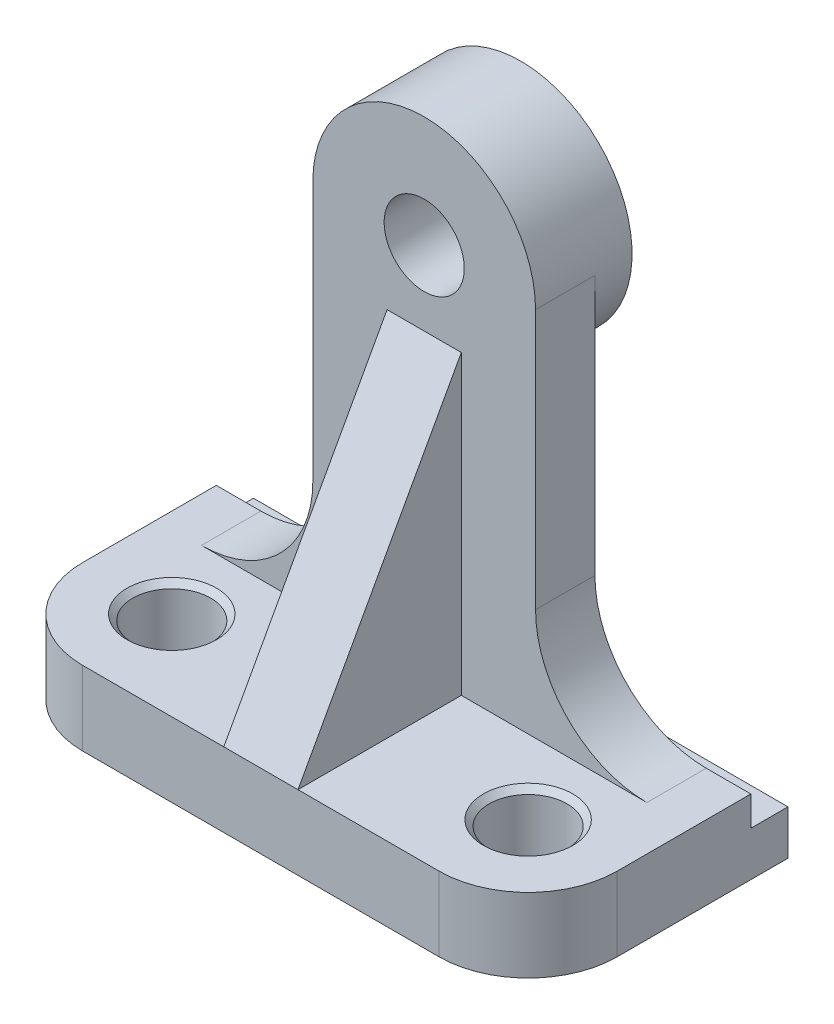
ISO-10303-21;
HEADER;
FILE_DESCRIPTION(('STEP AP214'),'2;1');
FILE_NAME('part.step','',(''),(''),'','','');
FILE_SCHEMA(('AUTOMOTIVE_DESIGN { 1 0 10303 214 1 1 1 1 }'));
ENDSEC;
DATA;
#1=APPLICATION_CONTEXT('core data for automotive mechanical design processes');
#2=APPLICATION_PROTOCOL_DEFINITION('international standard','automotive_design',2000,#1);
#3=PRODUCT_CONTEXT('',#1,'mechanical');
#4=PRODUCT('Part','Part','',(#3));
#5=PRODUCT_RELATED_PRODUCT_CATEGORY('part','',(#4));
#6=PRODUCT_DEFINITION_FORMATION('','',#4);
#7=PRODUCT_DEFINITION_CONTEXT('part definition',#1,'design');
#8=PRODUCT_DEFINITION('design','',#6,#7);
#9=PRODUCT_DEFINITION_SHAPE('','',#8);
#10=(LENGTH_UNIT() NAMED_UNIT(*) SI_UNIT(.MILLI.,.METRE.));
#11=(NAMED_UNIT(*) PLANE_ANGLE_UNIT() SI_UNIT($,.RADIAN.));
#12=(NAMED_UNIT(*) SI_UNIT($,.STERADIAN.) SOLID_ANGLE_UNIT());
#13=UNCERTAINTY_MEASURE_WITH_UNIT(LENGTH_MEASURE(1.E-05),#10,'distance_accuracy_value','');
#14=(GEOMETRIC_REPRESENTATION_CONTEXT(3) GLOBAL_UNCERTAINTY_ASSIGNED_CONTEXT((#13)) GLOBAL_UNIT_ASSIGNED_CONTEXT((#10,
#11,#12)) REPRESENTATION_CONTEXT('',''));
#15=CARTESIAN_POINT('',(0.,0.,0.));
#16=DIRECTION('',(0.,0.,1.));
#17=DIRECTION('',(1.,0.,0.));
#18=AXIS2_PLACEMENT_3D('',#15,#16,#17);
#19=CARTESIAN_POINT('',(0.,10.,0.));
#20=DIRECTION('',(0.,-1.,0.));
#21=DIRECTION('',(0.,0.,-1.));
#22=AXIS2_PLACEMENT_3D('',#19,#20,#21);
#23=PLANE('',#22);
#24=CARTESIAN_POINT('',(12.,10.,-12.));
#25=DIRECTION('',(0.,1.,0.));
#26=DIRECTION('',(0.,0.,1.));
#27=AXIS2_PLACEMENT_3D('',#24,#25,#26);
#28=CIRCLE('',#27,6.025);
#29=CARTESIAN_POINT('',(12.,10.,-5.975));
#30=VERTEX_POINT('',#29);
#31=EDGE_CURVE('E384',#30,#30,#28,.T.);
#32=ORIENTED_EDGE('',*,*,#31,.F.);
#33=EDGE_LOOP('',(#32));
#34=FACE_BOUND('',#33,.T.);
#35=DIRECTION('',(0.,0.,1.));
#36=VECTOR('',#35,1.);
#37=CARTESIAN_POINT('',(0.,10.,0.));
#38=LINE('',#37,#36);
#39=CARTESIAN_POINT('',(0.,10.,-30.));
#40=VERTEX_POINT('',#39);
#41=CARTESIAN_POINT('',(0.,10.,-12.));
#42=VERTEX_POINT('',#41);
#43=EDGE_CURVE('E208',#40,#42,#38,.T.);
#44=ORIENTED_EDGE('',*,*,#43,.T.);
#45=CARTESIAN_POINT('',(12.,10.,-12.));
#46=DIRECTION('',(0.,-1.,0.));
#47=DIRECTION('',(0.,0.,-1.));
#48=AXIS2_PLACEMENT_3D('',#45,#46,#47);
#49=CIRCLE('',#48,12.);
#50=CARTESIAN_POINT('',(12.,10.,0.));
#51=VERTEX_POINT('',#50);
#52=EDGE_CURVE('E256',#42,#51,#49,.F.);
#53=ORIENTED_EDGE('',*,*,#52,.T.);
#54=DIRECTION('',(1.,0.,0.));
#55=VECTOR('',#54,1.);
#56=CARTESIAN_POINT('',(72.,10.,0.));
#57=LINE('',#56,#55);
#58=CARTESIAN_POINT('',(31.,10.,0.));
#59=VERTEX_POINT('',#58);
#60=EDGE_CURVE('E197',#51,#59,#57,.T.);
#61=ORIENTED_EDGE('',*,*,#60,.T.);
#62=DIRECTION('',(0.,0.,1.));
#63=VECTOR('',#62,1.);
#64=CARTESIAN_POINT('',(31.,10.,0.));
#65=LINE('',#64,#63);
#66=CARTESIAN_POINT('',(31.,10.,-22.));
#67=VERTEX_POINT('',#66);
#68=EDGE_CURVE('E191',#67,#59,#65,.T.);
#69=ORIENTED_EDGE('',*,*,#68,.F.);
#70=DIRECTION('',(1.,0.,0.));
#71=VECTOR('',#70,1.);
#72=CARTESIAN_POINT('',(0.,10.,-22.));
#73=LINE('',#72,#71);
#74=CARTESIAN_POINT('',(6.,10.,-22.));
#75=VERTEX_POINT('',#74);
#76=EDGE_CURVE('E425',#75,#67,#73,.T.);
#77=ORIENTED_EDGE('',*,*,#76,.F.);
#78=DIRECTION('',(0.,0.,-1.));
#79=VECTOR('',#78,1.);
#80=CARTESIAN_POINT('',(6.,10.,-30.));
#81=LINE('',#80,#79);
#82=CARTESIAN_POINT('',(6.,10.,-30.));
#83=VERTEX_POINT('',#82);
#84=EDGE_CURVE('E229',#75,#83,#81,.T.);
#85=ORIENTED_EDGE('',*,*,#84,.T.);
#86=DIRECTION('',(1.,0.,0.));
#87=VECTOR('',#86,1.);
#88=CARTESIAN_POINT('',(0.,10.,-30.));
#89=LINE('',#88,#87);
#90=EDGE_CURVE('E286',#40,#83,#89,.T.);
#91=ORIENTED_EDGE('',*,*,#90,.F.);
#92=EDGE_LOOP('',(#44,#53,#61,#69,#77,#85,#91));
#93=FACE_BOUND('',#92,.T.);
#94=ADVANCED_FACE('F44',(#34,#93),#23,.F.);
#95=CARTESIAN_POINT('',(60.,10.,-12.));
#96=DIRECTION('',(0.,1.,0.));
#97=DIRECTION('',(0.,0.,1.));
#98=AXIS2_PLACEMENT_3D('',#95,#96,#97);
#99=CIRCLE('',#98,6.025);
#100=CARTESIAN_POINT('',(60.,10.,-5.975));
#101=VERTEX_POINT('',#100);
#102=EDGE_CURVE('E391',#101,#101,#99,.T.);
#103=ORIENTED_EDGE('',*,*,#102,.F.);
#104=EDGE_LOOP('',(#103));
#105=FACE_BOUND('',#104,.T.);
#106=CARTESIAN_POINT('',(41.,10.,0.));
#107=VERTEX_POINT('',#106);
#108=CARTESIAN_POINT('',(60.,10.,0.));
#109=VERTEX_POINT('',#108);
#110=EDGE_CURVE('E187',#107,#109,#57,.T.);
#111=ORIENTED_EDGE('',*,*,#110,.T.);
#112=CARTESIAN_POINT('',(60.,10.,-12.));
#113=DIRECTION('',(0.,-1.,0.));
#114=DIRECTION('',(0.,0.,-1.));
#115=AXIS2_PLACEMENT_3D('',#112,#113,#114);
#116=CIRCLE('',#115,12.);
#117=CARTESIAN_POINT('',(72.,10.,-12.));
#118=VERTEX_POINT('',#117);
#119=EDGE_CURVE('E11',#109,#118,#116,.F.);
#120=ORIENTED_EDGE('',*,*,#119,.T.);
#121=DIRECTION('',(0.,0.,-1.));
#122=VECTOR('',#121,1.);
#123=CARTESIAN_POINT('',(72.,10.,-35.));
#124=LINE('',#123,#122);
#125=CARTESIAN_POINT('',(72.,10.,-30.));
#126=VERTEX_POINT('',#125);
#127=EDGE_CURVE('E200',#118,#126,#124,.T.);
#128=ORIENTED_EDGE('',*,*,#127,.T.);
#129=CARTESIAN_POINT('',(66.,10.,-30.));
#130=VERTEX_POINT('',#129);
#131=EDGE_CURVE('E288',#130,#126,#89,.T.);
#132=ORIENTED_EDGE('',*,*,#131,.F.);
#133=DIRECTION('',(0.,0.,-1.));
#134=VECTOR('',#133,1.);
#135=CARTESIAN_POINT('',(66.,10.,0.));
#136=LINE('',#135,#134);
#137=CARTESIAN_POINT('',(66.,10.,-22.));
#138=VERTEX_POINT('',#137);
#139=EDGE_CURVE('E222',#130,#138,#136,.F.);
#140=ORIENTED_EDGE('',*,*,#139,.T.);
#141=CARTESIAN_POINT('',(41.,10.,-22.));
#142=VERTEX_POINT('',#141);
#143=EDGE_CURVE('E189',#142,#138,#73,.T.);
#144=ORIENTED_EDGE('',*,*,#143,.F.);
#145=DIRECTION('',(0.,0.,-1.));
#146=VECTOR('',#145,1.);
#147=CARTESIAN_POINT('',(41.,10.,0.));
#148=LINE('',#147,#146);
#149=EDGE_CURVE('E179',#107,#142,#148,.T.);
#150=ORIENTED_EDGE('',*,*,#149,.F.);
#151=EDGE_LOOP('',(#111,#120,#128,#132,#140,#144,#150));
#152=FACE_BOUND('',#151,.T.);
#153=ADVANCED_FACE('F186',(#105,#152),#23,.F.);
#154=CARTESIAN_POINT('',(0.,0.,-22.));
#155=DIRECTION('',(0.,0.,-1.));
#156=DIRECTION('',(-1.,0.,0.));
#157=AXIS2_PLACEMENT_3D('',#154,#155,#156);
#158=PLANE('',#157);
#159=DIRECTION('',(0.,-1.,0.));
#160=VECTOR('',#159,1.);
#161=CARTESIAN_POINT('',(31.,50.,-22.));
#162=LINE('',#161,#160);
#163=CARTESIAN_POINT('',(31.,50.,-22.));
#164=VERTEX_POINT('',#163);
#165=EDGE_CURVE('E401',#164,#67,#162,.T.);
#166=ORIENTED_EDGE('',*,*,#165,.F.);
#167=DIRECTION('',(-1.,0.,0.));
#168=VECTOR('',#167,1.);
#169=CARTESIAN_POINT('',(41.,50.,-22.));
#170=LINE('',#169,#168);
#171=CARTESIAN_POINT('',(41.,50.,-22.));
#172=VERTEX_POINT('',#171);
#173=EDGE_CURVE('E190',#172,#164,#170,.T.);
#174=ORIENTED_EDGE('',*,*,#173,.F.);
#175=DIRECTION('',(0.,-1.,0.));
#176=VECTOR('',#175,1.);
#177=CARTESIAN_POINT('',(41.,50.,-22.));
#178=LINE('',#177,#176);
#179=EDGE_CURVE('E181',#172,#142,#178,.T.);
#180=ORIENTED_EDGE('',*,*,#179,.T.);
#181=ORIENTED_EDGE('',*,*,#143,.T.);
#182=CARTESIAN_POINT('',(66.,25.,-22.));
#183=DIRECTION('',(0.,0.,-1.));
#184=DIRECTION('',(-1.,0.,0.));
#185=AXIS2_PLACEMENT_3D('',#182,#183,#184);
#186=CIRCLE('',#185,15.);
#187=CARTESIAN_POINT('',(51.,25.,-22.));
#188=VERTEX_POINT('',#187);
#189=EDGE_CURVE('E245',#138,#188,#186,.T.);
#190=ORIENTED_EDGE('',*,*,#189,.T.);
#191=DIRECTION('',(0.,-1.,0.));
#192=VECTOR('',#191,1.);
#193=CARTESIAN_POINT('',(51.,0.,-22.));
#194=LINE('',#193,#192);
#195=CARTESIAN_POINT('',(51.,60.,-22.));
#196=VERTEX_POINT('',#195);
#197=EDGE_CURVE('E422',#196,#188,#194,.T.);
#198=ORIENTED_EDGE('',*,*,#197,.F.);
#199=CARTESIAN_POINT('',(36.,60.,-22.));
#200=DIRECTION('',(0.,0.,-1.));
#201=DIRECTION('',(-1.,0.,0.));
#202=AXIS2_PLACEMENT_3D('',#199,#200,#201);
#203=CIRCLE('',#202,15.);
#204=CARTESIAN_POINT('',(21.,60.,-22.));
#205=VERTEX_POINT('',#204);
#206=EDGE_CURVE('E418',#205,#196,#203,.T.);
#207=ORIENTED_EDGE('',*,*,#206,.F.);
#208=DIRECTION('',(0.,-1.,0.));
#209=VECTOR('',#208,1.);
#210=CARTESIAN_POINT('',(21.,0.,-22.));
#211=LINE('',#210,#209);
#212=CARTESIAN_POINT('',(21.,25.,-22.));
#213=VERTEX_POINT('',#212);
#214=EDGE_CURVE('E416',#205,#213,#211,.T.);
#215=ORIENTED_EDGE('',*,*,#214,.T.);
#216=CARTESIAN_POINT('',(6.,25.,-22.));
#217=DIRECTION('',(0.,0.,-1.));
#218=DIRECTION('',(-1.,0.,0.));
#219=AXIS2_PLACEMENT_3D('',#216,#217,#218);
#220=CIRCLE('',#219,15.);
#221=EDGE_CURVE('E240',#213,#75,#220,.T.);
#222=ORIENTED_EDGE('',*,*,#221,.T.);
#223=ORIENTED_EDGE('',*,*,#76,.T.);
#224=EDGE_LOOP('',(#166,#174,#180,#181,#190,#198,#207,#215,#222,#223));
#225=FACE_BOUND('',#224,.T.);
#226=CARTESIAN_POINT('',(36.,60.,-22.));
#227=DIRECTION('',(0.,0.,-1.));
#228=DIRECTION('',(-1.,0.,0.));
#229=AXIS2_PLACEMENT_3D('',#226,#227,#228);
#230=CIRCLE('',#229,5.4);
#231=CARTESIAN_POINT('',(30.6,60.,-22.));
#232=VERTEX_POINT('',#231);
#233=EDGE_CURVE('E223',#232,#232,#230,.T.);
#234=ORIENTED_EDGE('',*,*,#233,.T.);
#235=EDGE_LOOP('',(#234));
#236=FACE_BOUND('',#235,.T.);
#237=ADVANCED_FACE('F316',(#225,#236),#158,.F.);
#238=CARTESIAN_POINT('',(0.,6.,-30.));
#239=DIRECTION('',(0.,0.,1.));
#240=DIRECTION('',(1.,0.,0.));
#241=AXIS2_PLACEMENT_3D('',#238,#239,#240);
#242=PLANE('',#241);
#243=CARTESIAN_POINT('',(36.,60.,-30.));
#244=DIRECTION('',(0.,0.,-1.));
#245=DIRECTION('',(-1.,0.,0.));
#246=AXIS2_PLACEMENT_3D('',#243,#244,#245);
#247=CIRCLE('',#246,15.);
#248=CARTESIAN_POINT('',(51.,60.,-30.));
#249=VERTEX_POINT('',#248);
#250=CARTESIAN_POINT('',(21.,60.,-30.));
#251=VERTEX_POINT('',#250);
#252=EDGE_CURVE('E226',#249,#251,#247,.T.);
#253=ORIENTED_EDGE('',*,*,#252,.F.);
#254=DIRECTION('',(0.,-1.,0.));
#255=VECTOR('',#254,1.);
#256=CARTESIAN_POINT('',(51.,0.,-30.));
#257=LINE('',#256,#255);
#258=CARTESIAN_POINT('',(51.,25.,-30.));
#259=VERTEX_POINT('',#258);
#260=EDGE_CURVE('E419',#249,#259,#257,.T.);
#261=ORIENTED_EDGE('',*,*,#260,.T.);
#262=CARTESIAN_POINT('',(66.,25.,-30.));
#263=DIRECTION('',(0.,0.,1.));
#264=DIRECTION('',(1.,0.,0.));
#265=AXIS2_PLACEMENT_3D('',#262,#263,#264);
#266=CIRCLE('',#265,15.);
#267=EDGE_CURVE('E243',#259,#130,#266,.T.);
#268=ORIENTED_EDGE('',*,*,#267,.T.);
#269=ORIENTED_EDGE('',*,*,#131,.T.);
#270=DIRECTION('',(0.,1.,0.));
#271=VECTOR('',#270,1.);
#272=CARTESIAN_POINT('',(72.,6.,-30.));
#273=LINE('',#272,#271);
#274=CARTESIAN_POINT('',(72.,6.,-30.));
#275=VERTEX_POINT('',#274);
#276=EDGE_CURVE('E214',#275,#126,#273,.T.);
#277=ORIENTED_EDGE('',*,*,#276,.F.);
#278=DIRECTION('',(1.,0.,0.));
#279=VECTOR('',#278,1.);
#280=CARTESIAN_POINT('',(0.,6.,-30.));
#281=LINE('',#280,#279);
#282=CARTESIAN_POINT('',(0.,6.,-30.));
#283=VERTEX_POINT('',#282);
#284=EDGE_CURVE('E279',#283,#275,#281,.T.);
#285=ORIENTED_EDGE('',*,*,#284,.F.);
#286=DIRECTION('',(0.,1.,0.));
#287=VECTOR('',#286,1.);
#288=CARTESIAN_POINT('',(0.,6.,-30.));
#289=LINE('',#288,#287);
#290=EDGE_CURVE('E205',#283,#40,#289,.T.);
#291=ORIENTED_EDGE('',*,*,#290,.T.);
#292=ORIENTED_EDGE('',*,*,#90,.T.);
#293=CARTESIAN_POINT('',(6.,25.,-30.));
#294=DIRECTION('',(0.,0.,1.));
#295=DIRECTION('',(1.,0.,0.));
#296=AXIS2_PLACEMENT_3D('',#293,#294,#295);
#297=CIRCLE('',#296,15.);
#298=CARTESIAN_POINT('',(21.,25.,-30.));
#299=VERTEX_POINT('',#298);
#300=EDGE_CURVE('E238',#83,#299,#297,.T.);
#301=ORIENTED_EDGE('',*,*,#300,.T.);
#302=DIRECTION('',(0.,-1.,0.));
#303=VECTOR('',#302,1.);
#304=CARTESIAN_POINT('',(21.,0.,-30.));
#305=LINE('',#304,#303);
#306=EDGE_CURVE('E413',#251,#299,#305,.T.);
#307=ORIENTED_EDGE('',*,*,#306,.F.);
#308=EDGE_LOOP('',(#253,#261,#268,#269,#277,#285,#291,#292,#301,#307));
#309=FACE_BOUND('',#308,.T.);
#310=ADVANCED_FACE('F293',(#309),#242,.F.);
#311=CARTESIAN_POINT('',(72.,10.,0.));
#312=DIRECTION('',(0.,0.,-1.));
#313=DIRECTION('',(-1.,0.,0.));
#314=AXIS2_PLACEMENT_3D('',#311,#312,#313);
#315=PLANE('',#314);
#316=ORIENTED_EDGE('',*,*,#60,.F.);
#317=DIRECTION('',(0.,-1.,0.));
#318=VECTOR('',#317,1.);
#319=CARTESIAN_POINT('',(12.,10.,0.));
#320=LINE('',#319,#318);
#321=CARTESIAN_POINT('',(12.,0.,0.));
#322=VERTEX_POINT('',#321);
#323=EDGE_CURVE('E248',#51,#322,#320,.T.);
#324=ORIENTED_EDGE('',*,*,#323,.T.);
#325=DIRECTION('',(1.,0.,0.));
#326=VECTOR('',#325,1.);
#327=CARTESIAN_POINT('',(72.,0.,0.));
#328=LINE('',#327,#326);
#329=CARTESIAN_POINT('',(60.,0.,0.));
#330=VERTEX_POINT('',#329);
#331=EDGE_CURVE('E211',#322,#330,#328,.T.);
#332=ORIENTED_EDGE('',*,*,#331,.T.);
#333=DIRECTION('',(0.,-1.,0.));
#334=VECTOR('',#333,1.);
#335=CARTESIAN_POINT('',(60.,10.,0.));
#336=LINE('',#335,#334);
#337=EDGE_CURVE('E196',#330,#109,#336,.F.);
#338=ORIENTED_EDGE('',*,*,#337,.T.);
#339=ORIENTED_EDGE('',*,*,#110,.F.);
#340=DIRECTION('',(1.,0.,0.));
#341=VECTOR('',#340,1.);
#342=CARTESIAN_POINT('',(0.999999999999994,10.,0.));
#343=LINE('',#342,#341);
#344=EDGE_CURVE('E164',#59,#107,#343,.T.);
#345=ORIENTED_EDGE('',*,*,#344,.F.);
#346=EDGE_LOOP('',(#316,#324,#332,#338,#339,#345));
#347=FACE_BOUND('',#346,.T.);
#348=ADVANCED_FACE('F193',(#347),#315,.F.);
#349=CARTESIAN_POINT('',(72.,10.,-35.));
#350=DIRECTION('',(-1.,0.,0.));
#351=DIRECTION('',(0.,0.,1.));
#352=AXIS2_PLACEMENT_3D('',#349,#350,#351);
#353=PLANE('',#352);
#354=ORIENTED_EDGE('',*,*,#127,.F.);
#355=DIRECTION('',(0.,-1.,0.));
#356=VECTOR('',#355,1.);
#357=CARTESIAN_POINT('',(72.,10.,-12.));
#358=LINE('',#357,#356);
#359=CARTESIAN_POINT('',(72.,0.,-12.));
#360=VERTEX_POINT('',#359);
#361=EDGE_CURVE('E52',#118,#360,#358,.T.);
#362=ORIENTED_EDGE('',*,*,#361,.T.);
#363=DIRECTION('',(0.,0.,-1.));
#364=VECTOR('',#363,1.);
#365=CARTESIAN_POINT('',(72.,0.,-35.));
#366=LINE('',#365,#364);
#367=CARTESIAN_POINT('',(72.,0.,-35.));
#368=VERTEX_POINT('',#367);
#369=EDGE_CURVE('E213',#360,#368,#366,.T.);
#370=ORIENTED_EDGE('',*,*,#369,.T.);
#371=DIRECTION('',(0.,-1.,0.));
#372=VECTOR('',#371,1.);
#373=CARTESIAN_POINT('',(72.,10.,-35.));
#374=LINE('',#373,#372);
#375=CARTESIAN_POINT('',(72.,6.,-35.));
#376=VERTEX_POINT('',#375);
#377=EDGE_CURVE('E219',#376,#368,#374,.T.);
#378=ORIENTED_EDGE('',*,*,#377,.F.);
#379=DIRECTION('',(0.,0.,-1.));
#380=VECTOR('',#379,1.);
#381=CARTESIAN_POINT('',(72.,6.,-35.));
#382=LINE('',#381,#380);
#383=EDGE_CURVE('E276',#275,#376,#382,.T.);
#384=ORIENTED_EDGE('',*,*,#383,.F.);
#385=ORIENTED_EDGE('',*,*,#276,.T.);
#386=EDGE_LOOP('',(#354,#362,#370,#378,#384,#385));
#387=FACE_BOUND('',#386,.T.);
#388=ADVANCED_FACE('F261',(#387),#353,.F.);
#389=CARTESIAN_POINT('',(0.,10.,-35.));
#390=DIRECTION('',(0.,0.,1.));
#391=DIRECTION('',(1.,0.,0.));
#392=AXIS2_PLACEMENT_3D('',#389,#390,#391);
#393=PLANE('',#392);
#394=DIRECTION('',(0.,-1.,0.));
#395=VECTOR('',#394,1.);
#396=CARTESIAN_POINT('',(0.,10.,-35.));
#397=LINE('',#396,#395);
#398=CARTESIAN_POINT('',(0.,6.,-35.));
#399=VERTEX_POINT('',#398);
#400=CARTESIAN_POINT('',(0.,0.,-35.));
#401=VERTEX_POINT('',#400);
#402=EDGE_CURVE('E210',#399,#401,#397,.T.);
#403=ORIENTED_EDGE('',*,*,#402,.F.);
#404=DIRECTION('',(-1.,0.,0.));
#405=VECTOR('',#404,1.);
#406=CARTESIAN_POINT('',(0.,6.,-35.));
#407=LINE('',#406,#405);
#408=EDGE_CURVE('E274',#376,#399,#407,.T.);
#409=ORIENTED_EDGE('',*,*,#408,.F.);
#410=ORIENTED_EDGE('',*,*,#377,.T.);
#411=DIRECTION('',(-1.,0.,0.));
#412=VECTOR('',#411,1.);
#413=CARTESIAN_POINT('',(0.,0.,-35.));
#414=LINE('',#413,#412);
#415=EDGE_CURVE('E201',#368,#401,#414,.T.);
#416=ORIENTED_EDGE('',*,*,#415,.T.);
#417=EDGE_LOOP('',(#403,#409,#410,#416));
#418=FACE_BOUND('',#417,.T.);
#419=ADVANCED_FACE('F272',(#418),#393,.F.);
#420=CARTESIAN_POINT('',(0.,10.,0.));
#421=DIRECTION('',(1.,0.,0.));
#422=DIRECTION('',(0.,0.,-1.));
#423=AXIS2_PLACEMENT_3D('',#420,#421,#422);
#424=PLANE('',#423);
#425=DIRECTION('',(0.,0.,1.));
#426=VECTOR('',#425,1.);
#427=CARTESIAN_POINT('',(0.,0.,0.));
#428=LINE('',#427,#426);
#429=CARTESIAN_POINT('',(0.,0.,-12.));
#430=VERTEX_POINT('',#429);
#431=EDGE_CURVE('E198',#401,#430,#428,.T.);
#432=ORIENTED_EDGE('',*,*,#431,.T.);
#433=DIRECTION('',(0.,-1.,0.));
#434=VECTOR('',#433,1.);
#435=CARTESIAN_POINT('',(0.,10.,-12.));
#436=LINE('',#435,#434);
#437=EDGE_CURVE('E65',#430,#42,#436,.F.);
#438=ORIENTED_EDGE('',*,*,#437,.T.);
#439=ORIENTED_EDGE('',*,*,#43,.F.);
#440=ORIENTED_EDGE('',*,*,#290,.F.);
#441=DIRECTION('',(0.,0.,1.));
#442=VECTOR('',#441,1.);
#443=CARTESIAN_POINT('',(0.,6.,-30.));
#444=LINE('',#443,#442);
#445=EDGE_CURVE('E282',#399,#283,#444,.T.);
#446=ORIENTED_EDGE('',*,*,#445,.F.);
#447=ORIENTED_EDGE('',*,*,#402,.T.);
#448=EDGE_LOOP('',(#432,#438,#439,#440,#446,#447));
#449=FACE_BOUND('',#448,.T.);
#450=ADVANCED_FACE('F299',(#449),#424,.F.);
#451=CARTESIAN_POINT('',(0.,0.,0.));
#452=DIRECTION('',(0.,-1.,0.));
#453=DIRECTION('',(0.,0.,-1.));
#454=AXIS2_PLACEMENT_3D('',#451,#452,#453);
#455=PLANE('',#454);
#456=CARTESIAN_POINT('',(12.,0.,-12.));
#457=DIRECTION('',(0.,1.,0.));
#458=DIRECTION('',(0.,0.,1.));
#459=AXIS2_PLACEMENT_3D('',#456,#457,#458);
#460=CIRCLE('',#459,5.25);
#461=CARTESIAN_POINT('',(12.,0.,-6.75));
#462=VERTEX_POINT('',#461);
#463=EDGE_CURVE('E386',#462,#462,#460,.T.);
#464=ORIENTED_EDGE('',*,*,#463,.T.);
#465=EDGE_LOOP('',(#464));
#466=FACE_BOUND('',#465,.T.);
#467=CARTESIAN_POINT('',(60.,0.,-12.));
#468=DIRECTION('',(0.,1.,0.));
#469=DIRECTION('',(0.,0.,1.));
#470=AXIS2_PLACEMENT_3D('',#467,#468,#469);
#471=CIRCLE('',#470,5.25);
#472=CARTESIAN_POINT('',(60.,0.,-6.75));
#473=VERTEX_POINT('',#472);
#474=EDGE_CURVE('E183',#473,#473,#471,.T.);
#475=ORIENTED_EDGE('',*,*,#474,.T.);
#476=EDGE_LOOP('',(#475));
#477=FACE_BOUND('',#476,.T.);
#478=ORIENTED_EDGE('',*,*,#331,.F.);
#479=CARTESIAN_POINT('',(12.,0.,-12.));
#480=DIRECTION('',(0.,-1.,0.));
#481=DIRECTION('',(0.,0.,-1.));
#482=AXIS2_PLACEMENT_3D('',#479,#480,#481);
#483=CIRCLE('',#482,12.);
#484=EDGE_CURVE('E253',#322,#430,#483,.T.);
#485=ORIENTED_EDGE('',*,*,#484,.T.);
#486=ORIENTED_EDGE('',*,*,#431,.F.);
#487=ORIENTED_EDGE('',*,*,#415,.F.);
#488=ORIENTED_EDGE('',*,*,#369,.F.);
#489=CARTESIAN_POINT('',(60.,0.,-12.));
#490=DIRECTION('',(0.,-1.,0.));
#491=DIRECTION('',(0.,0.,-1.));
#492=AXIS2_PLACEMENT_3D('',#489,#490,#491);
#493=CIRCLE('',#492,12.);
#494=EDGE_CURVE('E251',#360,#330,#493,.T.);
#495=ORIENTED_EDGE('',*,*,#494,.T.);
#496=EDGE_LOOP('',(#478,#485,#486,#487,#488,#495));
#497=FACE_BOUND('',#496,.T.);
#498=ADVANCED_FACE('F268',(#466,#477,#497),#455,.T.);
#499=CARTESIAN_POINT('',(0.,6.,0.));
#500=DIRECTION('',(0.,-1.,0.));
#501=DIRECTION('',(0.,0.,-1.));
#502=AXIS2_PLACEMENT_3D('',#499,#500,#501);
#503=PLANE('',#502);
#504=ORIENTED_EDGE('',*,*,#445,.T.);
#505=ORIENTED_EDGE('',*,*,#284,.T.);
#506=ORIENTED_EDGE('',*,*,#383,.T.);
#507=ORIENTED_EDGE('',*,*,#408,.T.);
#508=EDGE_LOOP('',(#504,#505,#506,#507));
#509=FACE_BOUND('',#508,.T.);
#510=ADVANCED_FACE('F306',(#509),#503,.F.);
#511=CARTESIAN_POINT('',(21.,0.,-22.));
#512=DIRECTION('',(1.,0.,0.));
#513=DIRECTION('',(0.,0.,-1.));
#514=AXIS2_PLACEMENT_3D('',#511,#512,#513);
#515=PLANE('',#514);
#516=ORIENTED_EDGE('',*,*,#306,.T.);
#517=DIRECTION('',(0.,0.,-1.));
#518=VECTOR('',#517,1.);
#519=CARTESIAN_POINT('',(21.,25.,-22.));
#520=LINE('',#519,#518);
#521=EDGE_CURVE('E232',#299,#213,#520,.F.);
#522=ORIENTED_EDGE('',*,*,#521,.T.);
#523=ORIENTED_EDGE('',*,*,#214,.F.);
#524=DIRECTION('',(0.,0.,-1.));
#525=VECTOR('',#524,1.);
#526=CARTESIAN_POINT('',(21.,60.,-22.));
#527=LINE('',#526,#525);
#528=EDGE_CURVE('E428',#205,#251,#527,.T.);
#529=ORIENTED_EDGE('',*,*,#528,.T.);
#530=EDGE_LOOP('',(#516,#522,#523,#529));
#531=FACE_BOUND('',#530,.T.);
#532=ADVANCED_FACE('F324',(#531),#515,.F.);
#533=CARTESIAN_POINT('',(51.,0.,-22.));
#534=DIRECTION('',(1.,0.,0.));
#535=DIRECTION('',(0.,0.,-1.));
#536=AXIS2_PLACEMENT_3D('',#533,#534,#535);
#537=PLANE('',#536);
#538=ORIENTED_EDGE('',*,*,#197,.T.);
#539=DIRECTION('',(0.,0.,-1.));
#540=VECTOR('',#539,1.);
#541=CARTESIAN_POINT('',(51.,25.,-22.));
#542=LINE('',#541,#540);
#543=EDGE_CURVE('E235',#188,#259,#542,.T.);
#544=ORIENTED_EDGE('',*,*,#543,.T.);
#545=ORIENTED_EDGE('',*,*,#260,.F.);
#546=DIRECTION('',(0.,0.,-1.));
#547=VECTOR('',#546,1.);
#548=CARTESIAN_POINT('',(51.,60.,-22.));
#549=LINE('',#548,#547);
#550=EDGE_CURVE('E433',#196,#249,#549,.T.);
#551=ORIENTED_EDGE('',*,*,#550,.F.);
#552=EDGE_LOOP('',(#538,#544,#545,#551));
#553=FACE_BOUND('',#552,.T.);
#554=ADVANCED_FACE('F327',(#553),#537,.T.);
#555=CARTESIAN_POINT('',(36.,60.,-22.));
#556=DIRECTION('',(0.,0.,-1.));
#557=DIRECTION('',(-1.,0.,0.));
#558=AXIS2_PLACEMENT_3D('',#555,#556,#557);
#559=CYLINDRICAL_SURFACE('',#558,15.);
#560=ORIENTED_EDGE('',*,*,#550,.T.);
#561=ORIENTED_EDGE('',*,*,#252,.T.);
#562=ORIENTED_EDGE('',*,*,#528,.F.);
#563=ORIENTED_EDGE('',*,*,#206,.T.);
#564=EDGE_LOOP('',(#560,#561,#562,#563));
#565=FACE_BOUND('',#564,.T.);
#566=CARTESIAN_POINT('',(36.,60.,-35.));
#567=DIRECTION('',(0.,0.,-1.));
#568=DIRECTION('',(-1.,0.,0.));
#569=AXIS2_PLACEMENT_3D('',#566,#567,#568);
#570=CIRCLE('',#569,15.);
#571=CARTESIAN_POINT('',(21.,60.,-35.));
#572=VERTEX_POINT('',#571);
#573=EDGE_CURVE('E410',#572,#572,#570,.T.);
#574=ORIENTED_EDGE('',*,*,#573,.F.);
#575=EDGE_LOOP('',(#574));
#576=FACE_BOUND('',#575,.T.);
#577=ADVANCED_FACE('F329',(#565,#576),#559,.T.);
#578=CARTESIAN_POINT('',(36.,60.,-35.));
#579=DIRECTION('',(0.,0.,-1.));
#580=DIRECTION('',(-1.,0.,0.));
#581=AXIS2_PLACEMENT_3D('',#578,#579,#580);
#582=PLANE('',#581);
#583=CARTESIAN_POINT('',(36.,60.,-35.));
#584=DIRECTION('',(0.,0.,-1.));
#585=DIRECTION('',(-1.,0.,0.));
#586=AXIS2_PLACEMENT_3D('',#583,#584,#585);
#587=CIRCLE('',#586,6.025);
#588=CARTESIAN_POINT('',(29.975,60.,-35.));
#589=VERTEX_POINT('',#588);
#590=EDGE_CURVE('E405',#589,#589,#587,.T.);
#591=ORIENTED_EDGE('',*,*,#590,.F.);
#592=EDGE_LOOP('',(#591));
#593=FACE_BOUND('',#592,.T.);
#594=ORIENTED_EDGE('',*,*,#573,.T.);
#595=EDGE_LOOP('',(#594));
#596=FACE_BOUND('',#595,.T.);
#597=ADVANCED_FACE('F332',(#593,#596),#582,.T.);
#598=CARTESIAN_POINT('',(36.,60.,-35.));
#599=DIRECTION('',(0.,0.,-1.));
#600=DIRECTION('',(-1.,0.,0.));
#601=AXIS2_PLACEMENT_3D('',#598,#599,#600);
#602=CYLINDRICAL_SURFACE('',#601,5.4);
#603=CARTESIAN_POINT('',(36.,60.,-34.375));
#604=DIRECTION('',(0.,0.,-1.));
#605=DIRECTION('',(-1.,0.,0.));
#606=AXIS2_PLACEMENT_3D('',#603,#604,#605);
#607=CIRCLE('',#606,5.4);
#608=CARTESIAN_POINT('',(30.6,60.,-34.375));
#609=VERTEX_POINT('',#608);
#610=EDGE_CURVE('E227',#609,#609,#607,.T.);
#611=ORIENTED_EDGE('',*,*,#610,.T.);
#612=EDGE_LOOP('',(#611));
#613=FACE_BOUND('',#612,.T.);
#614=ORIENTED_EDGE('',*,*,#233,.F.);
#615=EDGE_LOOP('',(#614));
#616=FACE_BOUND('',#615,.T.);
#617=ADVANCED_FACE('F342',(#613,#616),#602,.F.);
#618=CARTESIAN_POINT('',(36.,60.,-35.));
#619=DIRECTION('',(0.,0.,-1.));
#620=DIRECTION('',(-1.,0.,0.));
#621=AXIS2_PLACEMENT_3D('',#618,#619,#620);
#622=CONICAL_SURFACE('',#621,6.025,0.785398163397454);
#623=ORIENTED_EDGE('',*,*,#610,.F.);
#624=EDGE_LOOP('',(#623));
#625=FACE_BOUND('',#624,.T.);
#626=ORIENTED_EDGE('',*,*,#590,.T.);
#627=EDGE_LOOP('',(#626));
#628=FACE_BOUND('',#627,.T.);
#629=ADVANCED_FACE('F346',(#625,#628),#622,.F.);
#630=CARTESIAN_POINT('',(6.,25.,0.));
#631=DIRECTION('',(0.,0.,1.));
#632=DIRECTION('',(1.,0.,0.));
#633=AXIS2_PLACEMENT_3D('',#630,#631,#632);
#634=CYLINDRICAL_SURFACE('',#633,15.);
#635=ORIENTED_EDGE('',*,*,#221,.F.);
#636=ORIENTED_EDGE('',*,*,#521,.F.);
#637=ORIENTED_EDGE('',*,*,#300,.F.);
#638=ORIENTED_EDGE('',*,*,#84,.F.);
#639=EDGE_LOOP('',(#635,#636,#637,#638));
#640=FACE_BOUND('',#639,.T.);
#641=ADVANCED_FACE('F350',(#640),#634,.F.);
#642=CARTESIAN_POINT('',(66.,25.,-22.));
#643=DIRECTION('',(0.,0.,-1.));
#644=DIRECTION('',(-1.,0.,0.));
#645=AXIS2_PLACEMENT_3D('',#642,#643,#644);
#646=CYLINDRICAL_SURFACE('',#645,15.);
#647=ORIENTED_EDGE('',*,*,#189,.F.);
#648=ORIENTED_EDGE('',*,*,#139,.F.);
#649=ORIENTED_EDGE('',*,*,#267,.F.);
#650=ORIENTED_EDGE('',*,*,#543,.F.);
#651=EDGE_LOOP('',(#647,#648,#649,#650));
#652=FACE_BOUND('',#651,.T.);
#653=ADVANCED_FACE('F355',(#652),#646,.F.);
#654=CARTESIAN_POINT('',(31.,50.,0.));
#655=DIRECTION('',(1.,0.,0.));
#656=DIRECTION('',(0.,0.,-1.));
#657=AXIS2_PLACEMENT_3D('',#654,#655,#656);
#658=PLANE('',#657);
#659=ORIENTED_EDGE('',*,*,#68,.T.);
#660=DIRECTION('',(0.,0.876215908676647,-0.481918749772156));
#661=VECTOR('',#660,1.);
#662=CARTESIAN_POINT('',(31.,40.7101727447217,-16.8905950095969));
#663=LINE('',#662,#661);
#664=EDGE_CURVE('E170',#59,#164,#663,.T.);
#665=ORIENTED_EDGE('',*,*,#664,.T.);
#666=ORIENTED_EDGE('',*,*,#165,.T.);
#667=EDGE_LOOP('',(#659,#665,#666));
#668=FACE_BOUND('',#667,.T.);
#669=ADVANCED_FACE('F352',(#668),#658,.F.);
#670=CARTESIAN_POINT('',(41.,50.,0.));
#671=DIRECTION('',(-1.,0.,0.));
#672=DIRECTION('',(0.,0.,1.));
#673=AXIS2_PLACEMENT_3D('',#670,#671,#672);
#674=PLANE('',#673);
#675=ORIENTED_EDGE('',*,*,#179,.F.);
#676=DIRECTION('',(0.,0.876215908676647,-0.481918749772156));
#677=VECTOR('',#676,1.);
#678=CARTESIAN_POINT('',(41.,50.,-22.));
#679=LINE('',#678,#677);
#680=EDGE_CURVE('E167',#107,#172,#679,.T.);
#681=ORIENTED_EDGE('',*,*,#680,.F.);
#682=ORIENTED_EDGE('',*,*,#149,.T.);
#683=EDGE_LOOP('',(#675,#681,#682));
#684=FACE_BOUND('',#683,.T.);
#685=ADVANCED_FACE('F178',(#684),#674,.F.);
#686=CARTESIAN_POINT('',(0.999999999999994,50.,-22.));
#687=DIRECTION('',(0.,-0.481918749772156,-0.876215908676647));
#688=DIRECTION('',(0.,0.876215908676647,-0.481918749772156));
#689=AXIS2_PLACEMENT_3D('',#686,#687,#688);
#690=PLANE('',#689);
#691=ORIENTED_EDGE('',*,*,#344,.T.);
#692=ORIENTED_EDGE('',*,*,#680,.T.);
#693=ORIENTED_EDGE('',*,*,#173,.T.);
#694=ORIENTED_EDGE('',*,*,#664,.F.);
#695=EDGE_LOOP('',(#691,#692,#693,#694));
#696=FACE_BOUND('',#695,.T.);
#697=ADVANCED_FACE('F166',(#696),#690,.F.);
#698=CARTESIAN_POINT('',(12.,10.,-12.));
#699=DIRECTION('',(0.,-1.,0.));
#700=DIRECTION('',(0.,0.,-1.));
#701=AXIS2_PLACEMENT_3D('',#698,#699,#700);
#702=CYLINDRICAL_SURFACE('',#701,12.);
#703=ORIENTED_EDGE('',*,*,#52,.F.);
#704=ORIENTED_EDGE('',*,*,#437,.F.);
#705=ORIENTED_EDGE('',*,*,#484,.F.);
#706=ORIENTED_EDGE('',*,*,#323,.F.);
#707=EDGE_LOOP('',(#703,#704,#705,#706));
#708=FACE_BOUND('',#707,.T.);
#709=ADVANCED_FACE('F361',(#708),#702,.T.);
#710=CARTESIAN_POINT('',(60.,10.,-12.));
#711=DIRECTION('',(0.,-1.,0.));
#712=DIRECTION('',(0.,0.,-1.));
#713=AXIS2_PLACEMENT_3D('',#710,#711,#712);
#714=CYLINDRICAL_SURFACE('',#713,12.);
#715=ORIENTED_EDGE('',*,*,#119,.F.);
#716=ORIENTED_EDGE('',*,*,#337,.F.);
#717=ORIENTED_EDGE('',*,*,#494,.F.);
#718=ORIENTED_EDGE('',*,*,#361,.F.);
#719=EDGE_LOOP('',(#715,#716,#717,#718));
#720=FACE_BOUND('',#719,.T.);
#721=ADVANCED_FACE('F46',(#720),#714,.T.);
#722=CARTESIAN_POINT('',(60.,10.,-12.));
#723=DIRECTION('',(0.,1.,0.));
#724=DIRECTION('',(0.,0.,1.));
#725=AXIS2_PLACEMENT_3D('',#722,#723,#724);
#726=CYLINDRICAL_SURFACE('',#725,5.25);
#727=ORIENTED_EDGE('',*,*,#474,.F.);
#728=EDGE_LOOP('',(#727));
#729=FACE_BOUND('',#728,.T.);
#730=CARTESIAN_POINT('',(60.,9.225,-12.));
#731=DIRECTION('',(0.,1.,0.));
#732=DIRECTION('',(0.,0.,1.));
#733=AXIS2_PLACEMENT_3D('',#730,#731,#732);
#734=CIRCLE('',#733,5.25);
#735=CARTESIAN_POINT('',(60.,9.225,-6.75));
#736=VERTEX_POINT('',#735);
#737=EDGE_CURVE('E394',#736,#736,#734,.T.);
#738=ORIENTED_EDGE('',*,*,#737,.T.);
#739=EDGE_LOOP('',(#738));
#740=FACE_BOUND('',#739,.T.);
#741=ADVANCED_FACE('F362',(#729,#740),#726,.F.);
#742=CARTESIAN_POINT('',(60.,10.,-12.));
#743=DIRECTION('',(0.,1.,0.));
#744=DIRECTION('',(0.,0.,1.));
#745=AXIS2_PLACEMENT_3D('',#742,#743,#744);
#746=CONICAL_SURFACE('',#745,6.025,0.785398163397445);
#747=ORIENTED_EDGE('',*,*,#737,.F.);
#748=EDGE_LOOP('',(#747));
#749=FACE_BOUND('',#748,.T.);
#750=ORIENTED_EDGE('',*,*,#102,.T.);
#751=EDGE_LOOP('',(#750));
#752=FACE_BOUND('',#751,.T.);
#753=ADVANCED_FACE('F365',(#749,#752),#746,.F.);
#754=CARTESIAN_POINT('',(12.,10.,-12.));
#755=DIRECTION('',(0.,1.,0.));
#756=DIRECTION('',(0.,0.,1.));
#757=AXIS2_PLACEMENT_3D('',#754,#755,#756);
#758=CYLINDRICAL_SURFACE('',#757,5.25);
#759=ORIENTED_EDGE('',*,*,#463,.F.);
#760=EDGE_LOOP('',(#759));
#761=FACE_BOUND('',#760,.T.);
#762=CARTESIAN_POINT('',(12.,9.225,-12.));
#763=DIRECTION('',(0.,1.,0.));
#764=DIRECTION('',(0.,0.,1.));
#765=AXIS2_PLACEMENT_3D('',#762,#763,#764);
#766=CIRCLE('',#765,5.25);
#767=CARTESIAN_POINT('',(12.,9.225,-6.75));
#768=VERTEX_POINT('',#767);
#769=EDGE_CURVE('E382',#768,#768,#766,.T.);
#770=ORIENTED_EDGE('',*,*,#769,.T.);
#771=EDGE_LOOP('',(#770));
#772=FACE_BOUND('',#771,.T.);
#773=ADVANCED_FACE('F369',(#761,#772),#758,.F.);
#774=CARTESIAN_POINT('',(12.,10.,-12.));
#775=DIRECTION('',(0.,1.,0.));
#776=DIRECTION('',(0.,0.,1.));
#777=AXIS2_PLACEMENT_3D('',#774,#775,#776);
#778=CONICAL_SURFACE('',#777,6.025,0.785398163397449);
#779=ORIENTED_EDGE('',*,*,#769,.F.);
#780=EDGE_LOOP('',(#779));
#781=FACE_BOUND('',#780,.T.);
#782=ORIENTED_EDGE('',*,*,#31,.T.);
#783=EDGE_LOOP('',(#782));
#784=FACE_BOUND('',#783,.T.);
#785=ADVANCED_FACE('F373',(#781,#784),#778,.F.);
#786=CLOSED_SHELL('',(#94,#153,#237,#310,#348,#388,#419,#450,#498,#510,#532,#554,#577,#597,#617,
#629,#641,#653,#669,#685,#697,#709,#721,#741,#753,#773,#785));
#787=MANIFOLD_SOLID_BREP('B2',#786);
#788=ADVANCED_BREP_SHAPE_REPRESENTATION('',(#18,#787),#14);
#789=SHAPE_DEFINITION_REPRESENTATION(#9,#788);
ENDSEC;
END-ISO-10303-21;
